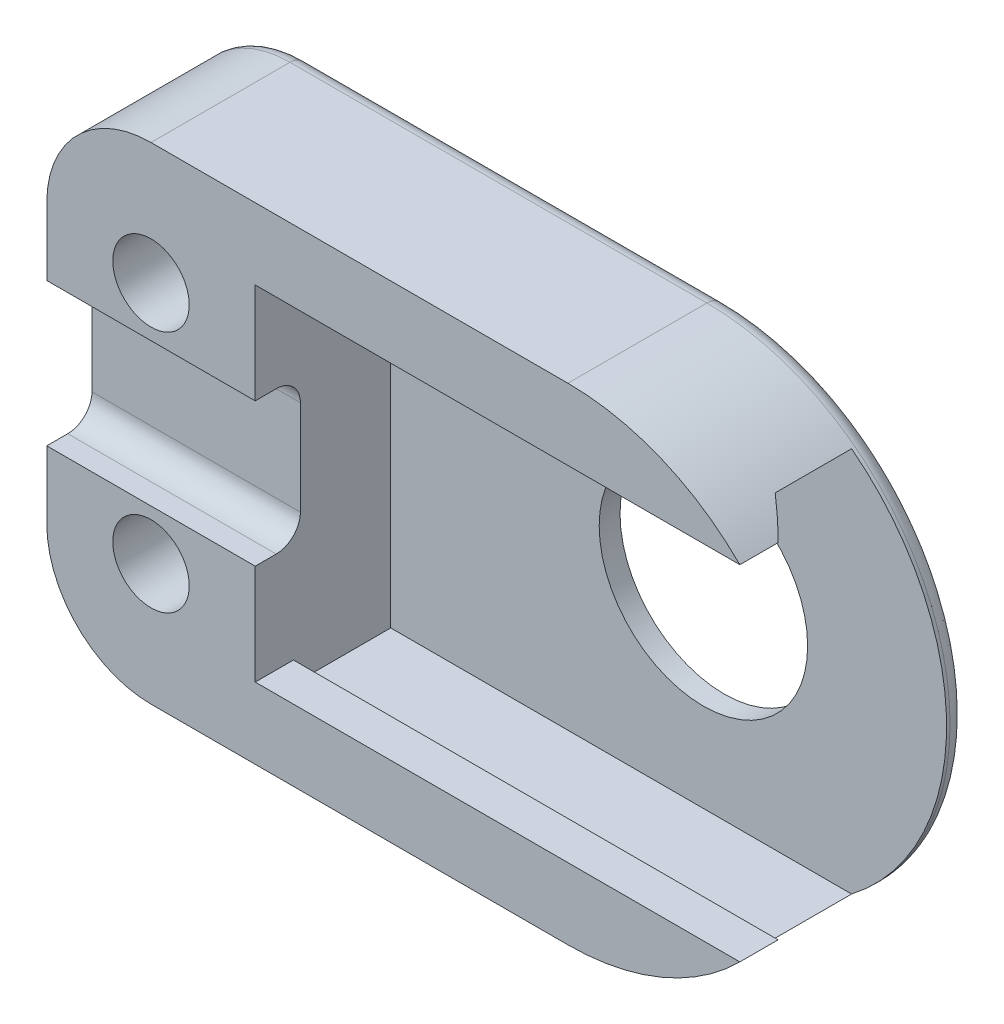
ISO-10303-21;
HEADER;
FILE_DESCRIPTION(('STEP AP214'),'2;1');
FILE_NAME('part.step','',(''),(''),'','','');
FILE_SCHEMA(('AUTOMOTIVE_DESIGN { 1 0 10303 214 1 1 1 1 }'));
ENDSEC;
DATA;
#1=APPLICATION_CONTEXT('core data for automotive mechanical design processes');
#2=APPLICATION_PROTOCOL_DEFINITION('international standard','automotive_design',2000,#1);
#3=PRODUCT_CONTEXT('',#1,'mechanical');
#4=PRODUCT('Part','Part','',(#3));
#5=PRODUCT_RELATED_PRODUCT_CATEGORY('part','',(#4));
#6=PRODUCT_DEFINITION_FORMATION('','',#4);
#7=PRODUCT_DEFINITION_CONTEXT('part definition',#1,'design');
#8=PRODUCT_DEFINITION('design','',#6,#7);
#9=PRODUCT_DEFINITION_SHAPE('','',#8);
#10=(LENGTH_UNIT() NAMED_UNIT(*) SI_UNIT(.MILLI.,.METRE.));
#11=(NAMED_UNIT(*) PLANE_ANGLE_UNIT() SI_UNIT($,.RADIAN.));
#12=(NAMED_UNIT(*) SI_UNIT($,.STERADIAN.) SOLID_ANGLE_UNIT());
#13=UNCERTAINTY_MEASURE_WITH_UNIT(LENGTH_MEASURE(1.E-05),#10,'distance_accuracy_value','');
#14=(GEOMETRIC_REPRESENTATION_CONTEXT(3) GLOBAL_UNCERTAINTY_ASSIGNED_CONTEXT((#13)) GLOBAL_UNIT_ASSIGNED_CONTEXT((#10,
#11,#12)) REPRESENTATION_CONTEXT('',''));
#15=CARTESIAN_POINT('',(0.,0.,0.));
#16=DIRECTION('',(0.,0.,1.));
#17=DIRECTION('',(1.,0.,0.));
#18=AXIS2_PLACEMENT_3D('',#15,#16,#17);
#19=CARTESIAN_POINT('',(0.,0.,4.5));
#20=DIRECTION('',(0.,0.,-0.999999999999998));
#21=DIRECTION('',(-1.,0.,0.));
#22=AXIS2_PLACEMENT_3D('',#19,#20,#21);
#23=PLANE('',#22);
#24=CARTESIAN_POINT('',(-12.,3.49999999999999,4.5));
#25=DIRECTION('',(0.,0.,0.999999999999998));
#26=DIRECTION('',(1.,0.,0.));
#27=AXIS2_PLACEMENT_3D('',#24,#25,#26);
#28=CIRCLE('',#27,1.1);
#29=CARTESIAN_POINT('',(-10.9,3.49999999999999,4.5));
#30=VERTEX_POINT('',#29);
#31=EDGE_CURVE('E380',#30,#30,#28,.T.);
#32=ORIENTED_EDGE('',*,*,#31,.F.);
#33=EDGE_LOOP('',(#32));
#34=FACE_BOUND('',#33,.T.);
#35=DIRECTION('',(-1.,0.,0.));
#36=VECTOR('',#35,1.);
#37=CARTESIAN_POINT('',(-15.,7.00000000000001,4.5));
#38=LINE('',#37,#36);
#39=CARTESIAN_POINT('',(0.,7.00000000000003,4.5));
#40=VERTEX_POINT('',#39);
#41=CARTESIAN_POINT('',(-12.,7.,4.50000000000001));
#42=VERTEX_POINT('',#41);
#43=EDGE_CURVE('E389',#40,#42,#38,.T.);
#44=ORIENTED_EDGE('',*,*,#43,.T.);
#45=CARTESIAN_POINT('',(-12.,4.00000000000001,4.5));
#46=DIRECTION('',(0.,0.,-0.999999999999998));
#47=DIRECTION('',(-1.,0.,0.));
#48=AXIS2_PLACEMENT_3D('',#45,#46,#47);
#49=CIRCLE('',#48,3.);
#50=CARTESIAN_POINT('',(-15.,4.00000000000001,4.5));
#51=VERTEX_POINT('',#50);
#52=EDGE_CURVE('E458',#42,#51,#49,.F.);
#53=ORIENTED_EDGE('',*,*,#52,.T.);
#54=DIRECTION('',(0.,-1.,0.));
#55=VECTOR('',#54,1.);
#56=CARTESIAN_POINT('',(-15.,7.00000000000001,4.5));
#57=LINE('',#56,#55);
#58=CARTESIAN_POINT('',(-15.,2.06,4.5));
#59=VERTEX_POINT('',#58);
#60=EDGE_CURVE('E394',#51,#59,#57,.T.);
#61=ORIENTED_EDGE('',*,*,#60,.T.);
#62=DIRECTION('',(-1.,0.,0.));
#63=VECTOR('',#62,1.);
#64=CARTESIAN_POINT('',(7.00000000000006,2.06000000000004,4.5));
#65=LINE('',#64,#63);
#66=CARTESIAN_POINT('',(-8.99999999999997,2.06000000000005,4.5));
#67=VERTEX_POINT('',#66);
#68=EDGE_CURVE('E274',#67,#59,#65,.T.);
#69=ORIENTED_EDGE('',*,*,#68,.F.);
#70=DIRECTION('',(0.,1.,0.));
#71=VECTOR('',#70,1.);
#72=CARTESIAN_POINT('',(-8.99999999999984,0.,4.5));
#73=LINE('',#72,#71);
#74=CARTESIAN_POINT('',(-8.99999999999999,4.95,4.5));
#75=VERTEX_POINT('',#74);
#76=EDGE_CURVE('E325',#67,#75,#73,.T.);
#77=ORIENTED_EDGE('',*,*,#76,.T.);
#78=DIRECTION('',(-1.,0.,0.));
#79=VECTOR('',#78,1.);
#80=CARTESIAN_POINT('',(7.00000000000001,4.95000000000001,4.50000000000001));
#81=LINE('',#80,#79);
#82=CARTESIAN_POINT('',(4.94949492372722,4.95000000000003,4.5));
#83=VERTEX_POINT('',#82);
#84=EDGE_CURVE('E353',#83,#75,#81,.T.);
#85=ORIENTED_EDGE('',*,*,#84,.F.);
#86=CARTESIAN_POINT('',(0.,0.,4.5));
#87=DIRECTION('',(0.,0.,0.999999999999998));
#88=DIRECTION('',(-1.,0.,0.));
#89=AXIS2_PLACEMENT_3D('',#86,#87,#88);
#90=CIRCLE('',#89,7.);
#91=EDGE_CURVE('E384',#83,#40,#90,.T.);
#92=ORIENTED_EDGE('',*,*,#91,.T.);
#93=EDGE_LOOP('',(#44,#53,#61,#69,#77,#85,#92));
#94=FACE_BOUND('',#93,.T.);
#95=ADVANCED_FACE('F52',(#34,#94),#23,.F.);
#96=CARTESIAN_POINT('',(-12.,-3.50000000000001,4.5));
#97=DIRECTION('',(0.,0.,0.999999999999998));
#98=DIRECTION('',(-1.,0.,0.));
#99=AXIS2_PLACEMENT_3D('',#96,#97,#98);
#100=CIRCLE('',#99,1.1);
#101=CARTESIAN_POINT('',(-13.1,-3.50000000000001,4.5));
#102=VERTEX_POINT('',#101);
#103=EDGE_CURVE('E376',#102,#102,#100,.T.);
#104=ORIENTED_EDGE('',*,*,#103,.F.);
#105=EDGE_LOOP('',(#104));
#106=FACE_BOUND('',#105,.T.);
#107=CARTESIAN_POINT('',(-15.,-2.05999999999999,4.5));
#108=VERTEX_POINT('',#107);
#109=CARTESIAN_POINT('',(-15.,-4.,4.5));
#110=VERTEX_POINT('',#109);
#111=EDGE_CURVE('E393',#108,#110,#57,.T.);
#112=ORIENTED_EDGE('',*,*,#111,.T.);
#113=CARTESIAN_POINT('',(-12.,-4.00000000000003,4.5));
#114=DIRECTION('',(0.,0.,-0.999999999999998));
#115=DIRECTION('',(-1.,0.,0.));
#116=AXIS2_PLACEMENT_3D('',#113,#114,#115);
#117=CIRCLE('',#116,3.);
#118=CARTESIAN_POINT('',(-12.,-7.00000000000001,4.5));
#119=VERTEX_POINT('',#118);
#120=EDGE_CURVE('E464',#110,#119,#117,.F.);
#121=ORIENTED_EDGE('',*,*,#120,.T.);
#122=DIRECTION('',(1.,0.,0.));
#123=VECTOR('',#122,1.);
#124=CARTESIAN_POINT('',(-15.,-7.,4.50000000000001));
#125=LINE('',#124,#123);
#126=CARTESIAN_POINT('',(0.,-6.99999999999999,4.50000000000001));
#127=VERTEX_POINT('',#126);
#128=EDGE_CURVE('E397',#119,#127,#125,.T.);
#129=ORIENTED_EDGE('',*,*,#128,.T.);
#130=CARTESIAN_POINT('',(4.94949492372711,-4.95000000000001,4.5));
#131=VERTEX_POINT('',#130);
#132=EDGE_CURVE('E385',#127,#131,#90,.T.);
#133=ORIENTED_EDGE('',*,*,#132,.T.);
#134=DIRECTION('',(-1.,0.,0.));
#135=VECTOR('',#134,1.);
#136=CARTESIAN_POINT('',(7.00000000000013,-4.95000000000001,4.5));
#137=LINE('',#136,#135);
#138=CARTESIAN_POINT('',(-8.99999999999999,-4.95,4.5));
#139=VERTEX_POINT('',#138);
#140=EDGE_CURVE('E357',#131,#139,#137,.T.);
#141=ORIENTED_EDGE('',*,*,#140,.T.);
#142=CARTESIAN_POINT('',(-8.99999999999999,-2.06,4.5));
#143=VERTEX_POINT('',#142);
#144=EDGE_CURVE('E326',#139,#143,#73,.T.);
#145=ORIENTED_EDGE('',*,*,#144,.T.);
#146=DIRECTION('',(-1.,0.,0.));
#147=VECTOR('',#146,1.);
#148=CARTESIAN_POINT('',(7.00000000000001,-2.06,4.5));
#149=LINE('',#148,#147);
#150=EDGE_CURVE('E299',#143,#108,#149,.T.);
#151=ORIENTED_EDGE('',*,*,#150,.T.);
#152=EDGE_LOOP('',(#112,#121,#129,#133,#141,#145,#151));
#153=FACE_BOUND('',#152,.T.);
#154=ADVANCED_FACE('F567',(#106,#153),#23,.F.);
#155=CARTESIAN_POINT('',(0.,0.,0.));
#156=DIRECTION('',(0.,0.,-0.999999999999998));
#157=DIRECTION('',(-1.,0.,0.));
#158=AXIS2_PLACEMENT_3D('',#155,#156,#157);
#159=PLANE('',#158);
#160=CARTESIAN_POINT('',(-12.,3.49999999999999,0.));
#161=DIRECTION('',(0.,0.,0.999999999999998));
#162=DIRECTION('',(1.,0.,0.));
#163=AXIS2_PLACEMENT_3D('',#160,#161,#162);
#164=CIRCLE('',#163,1.75);
#165=CARTESIAN_POINT('',(-10.25,3.49999999999999,0.));
#166=VERTEX_POINT('',#165);
#167=EDGE_CURVE('E532',#166,#166,#164,.T.);
#168=ORIENTED_EDGE('',*,*,#167,.T.);
#169=EDGE_LOOP('',(#168));
#170=FACE_BOUND('',#169,.T.);
#171=CARTESIAN_POINT('',(-12.,-3.5,0.));
#172=DIRECTION('',(0.,0.,0.999999999999998));
#173=DIRECTION('',(1.,0.,0.));
#174=AXIS2_PLACEMENT_3D('',#171,#172,#173);
#175=CIRCLE('',#174,1.75);
#176=CARTESIAN_POINT('',(-10.25,-3.5,0.));
#177=VERTEX_POINT('',#176);
#178=EDGE_CURVE('E543',#177,#177,#175,.T.);
#179=ORIENTED_EDGE('',*,*,#178,.T.);
#180=EDGE_LOOP('',(#179));
#181=FACE_BOUND('',#180,.T.);
#182=DIRECTION('',(0.,-1.,0.));
#183=VECTOR('',#182,1.);
#184=CARTESIAN_POINT('',(-14.5,4.00000000000001,0.));
#185=LINE('',#184,#183);
#186=CARTESIAN_POINT('',(-14.4999999999999,-3.99999999999999,0.));
#187=VERTEX_POINT('',#186);
#188=CARTESIAN_POINT('',(-14.5,4.00000000000001,0.));
#189=VERTEX_POINT('',#188);
#190=EDGE_CURVE('E467',#187,#189,#185,.F.);
#191=ORIENTED_EDGE('',*,*,#190,.T.);
#192=CARTESIAN_POINT('',(-12.,4.00000000000001,0.));
#193=DIRECTION('',(0.,0.,-0.999999999999998));
#194=DIRECTION('',(-1.,0.,0.));
#195=AXIS2_PLACEMENT_3D('',#192,#193,#194);
#196=CIRCLE('',#195,2.5);
#197=CARTESIAN_POINT('',(-12.,6.5,0.));
#198=VERTEX_POINT('',#197);
#199=EDGE_CURVE('E482',#189,#198,#196,.T.);
#200=ORIENTED_EDGE('',*,*,#199,.T.);
#201=DIRECTION('',(-1.,0.,0.));
#202=VECTOR('',#201,1.);
#203=CARTESIAN_POINT('',(1.2490009027033E-13,6.50000000000002,0.));
#204=LINE('',#203,#202);
#205=CARTESIAN_POINT('',(1.2490009027033E-13,6.50000000000002,0.));
#206=VERTEX_POINT('',#205);
#207=EDGE_CURVE('E479',#198,#206,#204,.F.);
#208=ORIENTED_EDGE('',*,*,#207,.T.);
#209=CARTESIAN_POINT('',(0.,0.,0.));
#210=DIRECTION('',(0.,0.,-0.999999999999998));
#211=DIRECTION('',(-1.,0.,0.));
#212=AXIS2_PLACEMENT_3D('',#209,#210,#211);
#213=CIRCLE('',#212,6.5);
#214=CARTESIAN_POINT('',(0.,-6.50000000000001,0.));
#215=VERTEX_POINT('',#214);
#216=EDGE_CURVE('E476',#206,#215,#213,.T.);
#217=ORIENTED_EDGE('',*,*,#216,.T.);
#218=DIRECTION('',(1.,0.,0.));
#219=VECTOR('',#218,1.);
#220=CARTESIAN_POINT('',(-12.,-6.5,0.));
#221=LINE('',#220,#219);
#222=CARTESIAN_POINT('',(-12.,-6.5,0.));
#223=VERTEX_POINT('',#222);
#224=EDGE_CURVE('E473',#215,#223,#221,.F.);
#225=ORIENTED_EDGE('',*,*,#224,.T.);
#226=CARTESIAN_POINT('',(-12.,-4.00000000000001,0.));
#227=DIRECTION('',(0.,0.,-0.999999999999998));
#228=DIRECTION('',(-1.,0.,0.));
#229=AXIS2_PLACEMENT_3D('',#226,#227,#228);
#230=CIRCLE('',#229,2.5);
#231=EDGE_CURVE('E470',#223,#187,#230,.T.);
#232=ORIENTED_EDGE('',*,*,#231,.T.);
#233=EDGE_LOOP('',(#191,#200,#208,#217,#225,#232));
#234=FACE_BOUND('',#233,.T.);
#235=CARTESIAN_POINT('',(0.,0.,0.));
#236=DIRECTION('',(0.,0.,-0.999999999999998));
#237=DIRECTION('',(-1.,0.,0.));
#238=AXIS2_PLACEMENT_3D('',#235,#236,#237);
#239=CIRCLE('',#238,3.);
#240=CARTESIAN_POINT('',(-3.00000000000001,0.,0.));
#241=VERTEX_POINT('',#240);
#242=EDGE_CURVE('E372',#241,#241,#239,.T.);
#243=ORIENTED_EDGE('',*,*,#242,.F.);
#244=EDGE_LOOP('',(#243));
#245=FACE_BOUND('',#244,.T.);
#246=ADVANCED_FACE('F547',(#170,#181,#234,#245),#159,.T.);
#247=CARTESIAN_POINT('',(0.,0.,4.5));
#248=DIRECTION('',(0.,0.,-0.999999999999998));
#249=DIRECTION('',(-1.,0.,0.));
#250=AXIS2_PLACEMENT_3D('',#247,#248,#249);
#251=CYLINDRICAL_SURFACE('',#250,7.);
#252=DIRECTION('',(0.,0.,-0.999999999999998));
#253=VECTOR('',#252,1.);
#254=CARTESIAN_POINT('',(0.,-6.99999999999999,4.50000000000001));
#255=LINE('',#254,#253);
#256=CARTESIAN_POINT('',(0.,-6.99999999999999,0.500000000000014));
#257=VERTEX_POINT('',#256);
#258=EDGE_CURVE('E400',#127,#257,#255,.T.);
#259=ORIENTED_EDGE('',*,*,#258,.T.);
#260=CARTESIAN_POINT('',(0.,0.,0.5));
#261=DIRECTION('',(0.,0.,-0.999999999999998));
#262=DIRECTION('',(-1.,0.,0.));
#263=AXIS2_PLACEMENT_3D('',#260,#261,#262);
#264=CIRCLE('',#263,7.);
#265=CARTESIAN_POINT('',(0.,7.,0.499999999999999));
#266=VERTEX_POINT('',#265);
#267=EDGE_CURVE('E493',#257,#266,#264,.F.);
#268=ORIENTED_EDGE('',*,*,#267,.T.);
#269=DIRECTION('',(0.,0.,-0.999999999999998));
#270=VECTOR('',#269,1.);
#271=CARTESIAN_POINT('',(0.,7.00000000000003,4.5));
#272=LINE('',#271,#270);
#273=EDGE_CURVE('E404',#40,#266,#272,.T.);
#274=ORIENTED_EDGE('',*,*,#273,.F.);
#275=ORIENTED_EDGE('',*,*,#91,.F.);
#276=DIRECTION('',(0.,0.,-0.999999999999998));
#277=VECTOR('',#276,1.);
#278=CARTESIAN_POINT('',(4.94949492372722,4.95000000000003,4.5));
#279=LINE('',#278,#277);
#280=CARTESIAN_POINT('',(4.94949492372709,4.94999999999999,3.40000000000002));
#281=VERTEX_POINT('',#280);
#282=EDGE_CURVE('E423',#281,#83,#279,.F.);
#283=ORIENTED_EDGE('',*,*,#282,.F.);
#284=CARTESIAN_POINT('',(0.,0.,8.35000000000013));
#285=DIRECTION('',(0.,-0.707106781186558,-0.707106781186536));
#286=DIRECTION('',(0.,0.70710678118654,-0.707106781186555));
#287=AXIS2_PLACEMENT_3D('',#284,#285,#286);
#288=ELLIPSE('',#287,9.8994949366118,7.);
#289=CARTESIAN_POINT('',(4.26585278695829,5.55000000000002,2.8));
#290=VERTEX_POINT('',#289);
#291=EDGE_CURVE('E426',#290,#281,#288,.T.);
#292=ORIENTED_EDGE('',*,*,#291,.F.);
#293=DIRECTION('',(0.,0.,-0.999999999999998));
#294=VECTOR('',#293,1.);
#295=CARTESIAN_POINT('',(4.26585278695846,5.55000000000006,4.5));
#296=LINE('',#295,#294);
#297=CARTESIAN_POINT('',(4.2658527869583,5.55000000000001,0.600000000000014));
#298=VERTEX_POINT('',#297);
#299=EDGE_CURVE('E429',#298,#290,#296,.F.);
#300=ORIENTED_EDGE('',*,*,#299,.F.);
#301=CARTESIAN_POINT('',(0.,0.,0.6));
#302=DIRECTION('',(0.,0.,-0.999999999999998));
#303=DIRECTION('',(-1.,0.,0.));
#304=AXIS2_PLACEMENT_3D('',#301,#302,#303);
#305=CIRCLE('',#304,7.);
#306=CARTESIAN_POINT('',(4.26585278695832,-5.55,0.600000000000028));
#307=VERTEX_POINT('',#306);
#308=EDGE_CURVE('E369',#298,#307,#305,.T.);
#309=ORIENTED_EDGE('',*,*,#308,.T.);
#310=DIRECTION('',(0.,0.,-0.999999999999998));
#311=VECTOR('',#310,1.);
#312=CARTESIAN_POINT('',(4.26585278695833,-5.55000000000002,4.5));
#313=LINE('',#312,#311);
#314=CARTESIAN_POINT('',(4.26585278695833,-5.55,2.8));
#315=VERTEX_POINT('',#314);
#316=EDGE_CURVE('E408',#307,#315,#313,.F.);
#317=ORIENTED_EDGE('',*,*,#316,.T.);
#318=CARTESIAN_POINT('',(0.,0.,8.35000000000012));
#319=DIRECTION('',(0.,-0.707106781186558,0.707106781186537));
#320=DIRECTION('',(0.,-0.70710678118654,-0.707106781186554));
#321=AXIS2_PLACEMENT_3D('',#318,#319,#320);
#322=ELLIPSE('',#321,9.89949493661178,7.);
#323=CARTESIAN_POINT('',(4.94949492372707,-4.95000000000001,3.40000000000002));
#324=VERTEX_POINT('',#323);
#325=EDGE_CURVE('E415',#315,#324,#322,.T.);
#326=ORIENTED_EDGE('',*,*,#325,.T.);
#327=DIRECTION('',(0.,0.,-0.999999999999998));
#328=VECTOR('',#327,1.);
#329=CARTESIAN_POINT('',(4.94949492372711,-4.95000000000001,4.5));
#330=LINE('',#329,#328);
#331=EDGE_CURVE('E419',#324,#131,#330,.F.);
#332=ORIENTED_EDGE('',*,*,#331,.T.);
#333=ORIENTED_EDGE('',*,*,#132,.F.);
#334=EDGE_LOOP('',(#259,#268,#274,#275,#283,#292,#300,#309,#317,#326,#332,#333));
#335=FACE_BOUND('',#334,.T.);
#336=ADVANCED_FACE('F582',(#335),#251,.T.);
#337=CARTESIAN_POINT('',(-15.,7.00000000000001,4.5));
#338=DIRECTION('',(0.,-1.,0.));
#339=DIRECTION('',(0.,0.,-0.999999999999998));
#340=AXIS2_PLACEMENT_3D('',#337,#338,#339);
#341=PLANE('',#340);
#342=ORIENTED_EDGE('',*,*,#273,.T.);
#343=DIRECTION('',(-1.,0.,0.));
#344=VECTOR('',#343,1.);
#345=CARTESIAN_POINT('',(-12.,7.00000000000001,0.500000000000014));
#346=LINE('',#345,#344);
#347=CARTESIAN_POINT('',(-12.,7.00000000000001,0.500000000000014));
#348=VERTEX_POINT('',#347);
#349=EDGE_CURVE('E490',#266,#348,#346,.T.);
#350=ORIENTED_EDGE('',*,*,#349,.T.);
#351=DIRECTION('',(0.,0.,-0.999999999999998));
#352=VECTOR('',#351,1.);
#353=CARTESIAN_POINT('',(-12.,7.,4.50000000000001));
#354=LINE('',#353,#352);
#355=EDGE_CURVE('E455',#348,#42,#354,.F.);
#356=ORIENTED_EDGE('',*,*,#355,.T.);
#357=ORIENTED_EDGE('',*,*,#43,.F.);
#358=EDGE_LOOP('',(#342,#350,#356,#357));
#359=FACE_BOUND('',#358,.T.);
#360=ADVANCED_FACE('F590',(#359),#341,.F.);
#361=CARTESIAN_POINT('',(-15.,7.00000000000001,4.5));
#362=DIRECTION('',(1.,0.,0.));
#363=DIRECTION('',(0.,1.,0.));
#364=AXIS2_PLACEMENT_3D('',#361,#362,#363);
#365=PLANE('',#364);
#366=DIRECTION('',(0.,0.,-0.999999999999998));
#367=VECTOR('',#366,1.);
#368=CARTESIAN_POINT('',(-15.,4.00000000000001,4.5));
#369=LINE('',#368,#367);
#370=CARTESIAN_POINT('',(-15.,4.,0.5));
#371=VERTEX_POINT('',#370);
#372=EDGE_CURVE('E452',#51,#371,#369,.T.);
#373=ORIENTED_EDGE('',*,*,#372,.T.);
#374=DIRECTION('',(0.,-1.,0.));
#375=VECTOR('',#374,1.);
#376=CARTESIAN_POINT('',(-15.,-4.,0.500000000000013));
#377=LINE('',#376,#375);
#378=CARTESIAN_POINT('',(-15.,-4.,0.500000000000013));
#379=VERTEX_POINT('',#378);
#380=EDGE_CURVE('E13',#371,#379,#377,.T.);
#381=ORIENTED_EDGE('',*,*,#380,.T.);
#382=DIRECTION('',(0.,0.,-0.999999999999998));
#383=VECTOR('',#382,1.);
#384=CARTESIAN_POINT('',(-15.,-4.,4.5));
#385=LINE('',#384,#383);
#386=EDGE_CURVE('E449',#379,#110,#385,.F.);
#387=ORIENTED_EDGE('',*,*,#386,.T.);
#388=ORIENTED_EDGE('',*,*,#111,.F.);
#389=DIRECTION('',(0.,0.,0.999999999999998));
#390=VECTOR('',#389,1.);
#391=CARTESIAN_POINT('',(-15.,-2.05999999999999,4.5));
#392=LINE('',#391,#390);
#393=CARTESIAN_POINT('',(-15.,-2.05999999999999,3.89665998448863));
#394=VERTEX_POINT('',#393);
#395=EDGE_CURVE('E267',#394,#108,#392,.T.);
#396=ORIENTED_EDGE('',*,*,#395,.F.);
#397=CARTESIAN_POINT('',(-15.,-1.36334001551138,3.89665998448864));
#398=DIRECTION('',(-1.,0.,0.));
#399=DIRECTION('',(0.,1.,0.));
#400=AXIS2_PLACEMENT_3D('',#397,#398,#399);
#401=CIRCLE('',#400,0.696659984488627);
#402=CARTESIAN_POINT('',(-15.,-1.36334001551138,3.20000000000001));
#403=VERTEX_POINT('',#402);
#404=EDGE_CURVE('E287',#403,#394,#401,.T.);
#405=ORIENTED_EDGE('',*,*,#404,.F.);
#406=DIRECTION('',(0.,-1.,0.));
#407=VECTOR('',#406,1.);
#408=CARTESIAN_POINT('',(-15.,1.36334001551137,3.2));
#409=LINE('',#408,#407);
#410=CARTESIAN_POINT('',(-15.,1.36334001551137,3.2));
#411=VERTEX_POINT('',#410);
#412=EDGE_CURVE('E282',#411,#403,#409,.T.);
#413=ORIENTED_EDGE('',*,*,#412,.F.);
#414=CARTESIAN_POINT('',(-14.9999999999998,1.36334001551141,3.89665998448863));
#415=DIRECTION('',(-1.,0.,0.));
#416=DIRECTION('',(0.,-1.,0.));
#417=AXIS2_PLACEMENT_3D('',#414,#415,#416);
#418=CIRCLE('',#417,0.696659984488628);
#419=CARTESIAN_POINT('',(-15.,2.06,3.89665998448864));
#420=VERTEX_POINT('',#419);
#421=EDGE_CURVE('E259',#420,#411,#418,.T.);
#422=ORIENTED_EDGE('',*,*,#421,.F.);
#423=DIRECTION('',(0.,0.,-0.999999999999998));
#424=VECTOR('',#423,1.);
#425=CARTESIAN_POINT('',(-15.,2.06,4.5));
#426=LINE('',#425,#424);
#427=EDGE_CURVE('E271',#59,#420,#426,.T.);
#428=ORIENTED_EDGE('',*,*,#427,.F.);
#429=ORIENTED_EDGE('',*,*,#60,.F.);
#430=EDGE_LOOP('',(#373,#381,#387,#388,#396,#405,#413,#422,#428,#429));
#431=FACE_BOUND('',#430,.T.);
#432=ADVANCED_FACE('F279',(#431),#365,.F.);
#433=CARTESIAN_POINT('',(-15.,-7.,4.50000000000001));
#434=DIRECTION('',(0.,1.,0.));
#435=DIRECTION('',(0.,0.,0.999999999999998));
#436=AXIS2_PLACEMENT_3D('',#433,#434,#435);
#437=PLANE('',#436);
#438=DIRECTION('',(0.,0.,-0.999999999999998));
#439=VECTOR('',#438,1.);
#440=CARTESIAN_POINT('',(-12.,-7.00000000000001,4.5));
#441=LINE('',#440,#439);
#442=CARTESIAN_POINT('',(-12.,-7.,0.5));
#443=VERTEX_POINT('',#442);
#444=EDGE_CURVE('E461',#119,#443,#441,.T.);
#445=ORIENTED_EDGE('',*,*,#444,.T.);
#446=DIRECTION('',(1.,0.,0.));
#447=VECTOR('',#446,1.);
#448=CARTESIAN_POINT('',(0.,-6.99999999999999,0.500000000000014));
#449=LINE('',#448,#447);
#450=EDGE_CURVE('E496',#443,#257,#449,.T.);
#451=ORIENTED_EDGE('',*,*,#450,.T.);
#452=ORIENTED_EDGE('',*,*,#258,.F.);
#453=ORIENTED_EDGE('',*,*,#128,.F.);
#454=EDGE_LOOP('',(#445,#451,#452,#453));
#455=FACE_BOUND('',#454,.T.);
#456=ADVANCED_FACE('F584',(#455),#437,.F.);
#457=CARTESIAN_POINT('',(-12.,3.49999999999999,4.5));
#458=DIRECTION('',(0.,0.,-0.999999999999998));
#459=DIRECTION('',(-1.,0.,0.));
#460=AXIS2_PLACEMENT_3D('',#457,#458,#459);
#461=CYLINDRICAL_SURFACE('',#460,1.1);
#462=CARTESIAN_POINT('',(-12.,3.5,1.00000000000001));
#463=DIRECTION('',(0.,0.,0.999999999999998));
#464=DIRECTION('',(1.,0.,0.));
#465=AXIS2_PLACEMENT_3D('',#462,#463,#464);
#466=CIRCLE('',#465,1.1);
#467=CARTESIAN_POINT('',(-10.9,3.5,1.00000000000001));
#468=VERTEX_POINT('',#467);
#469=EDGE_CURVE('E56',#468,#468,#466,.T.);
#470=ORIENTED_EDGE('',*,*,#469,.F.);
#471=EDGE_LOOP('',(#470));
#472=FACE_BOUND('',#471,.T.);
#473=ORIENTED_EDGE('',*,*,#31,.T.);
#474=EDGE_LOOP('',(#473));
#475=FACE_BOUND('',#474,.T.);
#476=ADVANCED_FACE('F578',(#472,#475),#461,.F.);
#477=CARTESIAN_POINT('',(-12.,-3.50000000000001,4.5));
#478=DIRECTION('',(0.,0.,-0.999999999999998));
#479=DIRECTION('',(-1.,0.,0.));
#480=AXIS2_PLACEMENT_3D('',#477,#478,#479);
#481=CYLINDRICAL_SURFACE('',#480,1.1);
#482=CARTESIAN_POINT('',(-12.,-3.50000000000001,1.));
#483=DIRECTION('',(0.,0.,0.999999999999998));
#484=DIRECTION('',(1.,0.,0.));
#485=AXIS2_PLACEMENT_3D('',#482,#483,#484);
#486=CIRCLE('',#485,1.1);
#487=CARTESIAN_POINT('',(-10.9,-3.50000000000001,1.));
#488=VERTEX_POINT('',#487);
#489=EDGE_CURVE('E521',#488,#488,#486,.T.);
#490=ORIENTED_EDGE('',*,*,#489,.F.);
#491=EDGE_LOOP('',(#490));
#492=FACE_BOUND('',#491,.T.);
#493=ORIENTED_EDGE('',*,*,#103,.T.);
#494=EDGE_LOOP('',(#493));
#495=FACE_BOUND('',#494,.T.);
#496=ADVANCED_FACE('F677',(#492,#495),#481,.F.);
#497=CARTESIAN_POINT('',(0.,0.,9.99999999999999));
#498=DIRECTION('',(0.,0.,-0.999999999999998));
#499=DIRECTION('',(-1.,0.,0.));
#500=AXIS2_PLACEMENT_3D('',#497,#498,#499);
#501=CYLINDRICAL_SURFACE('',#500,3.);
#502=CARTESIAN_POINT('',(0.,0.,0.6));
#503=DIRECTION('',(0.,0.,-0.999999999999998));
#504=DIRECTION('',(-1.,0.,0.));
#505=AXIS2_PLACEMENT_3D('',#502,#503,#504);
#506=CIRCLE('',#505,3.);
#507=CARTESIAN_POINT('',(-3.00000000000001,0.,0.6));
#508=VERTEX_POINT('',#507);
#509=EDGE_CURVE('E346',#508,#508,#506,.F.);
#510=ORIENTED_EDGE('',*,*,#509,.T.);
#511=EDGE_LOOP('',(#510));
#512=FACE_BOUND('',#511,.T.);
#513=ORIENTED_EDGE('',*,*,#242,.T.);
#514=EDGE_LOOP('',(#513));
#515=FACE_BOUND('',#514,.T.);
#516=ADVANCED_FACE('F674',(#512,#515),#501,.F.);
#517=CARTESIAN_POINT('',(7.00000000000001,5.55,0.));
#518=DIRECTION('',(0.,-1.,0.));
#519=DIRECTION('',(0.,0.,-0.999999999999998));
#520=AXIS2_PLACEMENT_3D('',#517,#518,#519);
#521=PLANE('',#520);
#522=ORIENTED_EDGE('',*,*,#299,.T.);
#523=DIRECTION('',(-1.,0.,0.));
#524=VECTOR('',#523,1.);
#525=CARTESIAN_POINT('',(7.00000000000001,5.55,2.80000000000001));
#526=LINE('',#525,#524);
#527=CARTESIAN_POINT('',(-9.00000000000001,5.55000000000001,2.80000000000001));
#528=VERTEX_POINT('',#527);
#529=EDGE_CURVE('E347',#290,#528,#526,.T.);
#530=ORIENTED_EDGE('',*,*,#529,.T.);
#531=DIRECTION('',(0.,0.,0.999999999999998));
#532=VECTOR('',#531,1.);
#533=CARTESIAN_POINT('',(-9.00000000000001,5.55,0.));
#534=LINE('',#533,#532);
#535=CARTESIAN_POINT('',(-9.00000000000001,5.55,0.600000000000014));
#536=VERTEX_POINT('',#535);
#537=EDGE_CURVE('E338',#536,#528,#534,.T.);
#538=ORIENTED_EDGE('',*,*,#537,.F.);
#539=DIRECTION('',(-1.,0.,0.));
#540=VECTOR('',#539,1.);
#541=CARTESIAN_POINT('',(7.00000000000001,5.55,0.600000000000028));
#542=LINE('',#541,#540);
#543=EDGE_CURVE('E343',#298,#536,#542,.T.);
#544=ORIENTED_EDGE('',*,*,#543,.F.);
#545=EDGE_LOOP('',(#522,#530,#538,#544));
#546=FACE_BOUND('',#545,.T.);
#547=ADVANCED_FACE('F676',(#546),#521,.T.);
#548=CARTESIAN_POINT('',(7.00000000000005,4.17500000000009,4.17499999999996));
#549=DIRECTION('',(0.,-0.707106781186558,-0.707106781186536));
#550=DIRECTION('',(0.,0.70710678118654,-0.707106781186555));
#551=AXIS2_PLACEMENT_3D('',#548,#549,#550);
#552=PLANE('',#551);
#553=ORIENTED_EDGE('',*,*,#291,.T.);
#554=DIRECTION('',(-1.,0.,0.));
#555=VECTOR('',#554,1.);
#556=CARTESIAN_POINT('',(7.00000000000001,4.95000000000003,3.40000000000003));
#557=LINE('',#556,#555);
#558=CARTESIAN_POINT('',(-9.00000000000001,4.94999999999999,3.40000000000003));
#559=VERTEX_POINT('',#558);
#560=EDGE_CURVE('E350',#281,#559,#557,.T.);
#561=ORIENTED_EDGE('',*,*,#560,.T.);
#562=DIRECTION('',(0.,-0.70710678118654,0.707106781186555));
#563=VECTOR('',#562,1.);
#564=CARTESIAN_POINT('',(-8.99999999999999,4.17500000000008,4.17499999999996));
#565=LINE('',#564,#563);
#566=EDGE_CURVE('E334',#528,#559,#565,.T.);
#567=ORIENTED_EDGE('',*,*,#566,.F.);
#568=ORIENTED_EDGE('',*,*,#529,.F.);
#569=EDGE_LOOP('',(#553,#561,#567,#568));
#570=FACE_BOUND('',#569,.T.);
#571=ADVANCED_FACE('F655',(#570),#552,.T.);
#572=CARTESIAN_POINT('',(6.99999999999998,4.95000000000003,0.));
#573=DIRECTION('',(0.,-1.,0.));
#574=DIRECTION('',(1.,0.,0.));
#575=AXIS2_PLACEMENT_3D('',#572,#573,#574);
#576=PLANE('',#575);
#577=ORIENTED_EDGE('',*,*,#282,.T.);
#578=ORIENTED_EDGE('',*,*,#84,.T.);
#579=DIRECTION('',(0.,0.,0.999999999999998));
#580=VECTOR('',#579,1.);
#581=CARTESIAN_POINT('',(-9.00000000000001,4.94999999999999,0.));
#582=LINE('',#581,#580);
#583=EDGE_CURVE('E330',#559,#75,#582,.T.);
#584=ORIENTED_EDGE('',*,*,#583,.F.);
#585=ORIENTED_EDGE('',*,*,#560,.F.);
#586=EDGE_LOOP('',(#577,#578,#584,#585));
#587=FACE_BOUND('',#586,.T.);
#588=ADVANCED_FACE('F646',(#587),#576,.T.);
#589=CARTESIAN_POINT('',(7.00000000000001,-4.94999999999999,0.));
#590=DIRECTION('',(0.,-1.,0.));
#591=DIRECTION('',(1.,0.,0.));
#592=AXIS2_PLACEMENT_3D('',#589,#590,#591);
#593=PLANE('',#592);
#594=DIRECTION('',(-1.,0.,0.));
#595=VECTOR('',#594,1.);
#596=CARTESIAN_POINT('',(7.00000000000001,-4.94999999999999,3.40000000000001));
#597=LINE('',#596,#595);
#598=CARTESIAN_POINT('',(-9.00000000000001,-4.95000000000001,3.40000000000003));
#599=VERTEX_POINT('',#598);
#600=EDGE_CURVE('E361',#324,#599,#597,.T.);
#601=ORIENTED_EDGE('',*,*,#600,.T.);
#602=DIRECTION('',(0.,0.,0.999999999999998));
#603=VECTOR('',#602,1.);
#604=CARTESIAN_POINT('',(-9.00000000000001,-4.95000000000001,0.));
#605=LINE('',#604,#603);
#606=EDGE_CURVE('E321',#599,#139,#605,.T.);
#607=ORIENTED_EDGE('',*,*,#606,.T.);
#608=ORIENTED_EDGE('',*,*,#140,.F.);
#609=ORIENTED_EDGE('',*,*,#331,.F.);
#610=EDGE_LOOP('',(#601,#607,#608,#609));
#611=FACE_BOUND('',#610,.T.);
#612=ADVANCED_FACE('F699',(#611),#593,.F.);
#613=CARTESIAN_POINT('',(7.00000000000013,-4.1750000000001,4.17499999999997));
#614=DIRECTION('',(0.,-0.707106781186558,0.707106781186537));
#615=DIRECTION('',(0.,-0.707106781186541,-0.707106781186554));
#616=AXIS2_PLACEMENT_3D('',#613,#614,#615);
#617=PLANE('',#616);
#618=DIRECTION('',(-1.,0.,0.));
#619=VECTOR('',#618,1.);
#620=CARTESIAN_POINT('',(7.00000000000001,-5.55,2.80000000000001));
#621=LINE('',#620,#619);
#622=CARTESIAN_POINT('',(-9.00000000000001,-5.55000000000001,2.80000000000001));
#623=VERTEX_POINT('',#622);
#624=EDGE_CURVE('E364',#315,#623,#621,.T.);
#625=ORIENTED_EDGE('',*,*,#624,.T.);
#626=DIRECTION('',(0.,0.707106781186541,0.707106781186554));
#627=VECTOR('',#626,1.);
#628=CARTESIAN_POINT('',(-8.99999999999999,-4.17500000000007,4.17499999999997));
#629=LINE('',#628,#627);
#630=EDGE_CURVE('E317',#623,#599,#629,.T.);
#631=ORIENTED_EDGE('',*,*,#630,.T.);
#632=ORIENTED_EDGE('',*,*,#600,.F.);
#633=ORIENTED_EDGE('',*,*,#325,.F.);
#634=EDGE_LOOP('',(#625,#631,#632,#633));
#635=FACE_BOUND('',#634,.T.);
#636=ADVANCED_FACE('F695',(#635),#617,.F.);
#637=CARTESIAN_POINT('',(7.00000000000001,-5.54999999999999,0.));
#638=DIRECTION('',(0.,-1.,0.));
#639=DIRECTION('',(0.,0.,-0.999999999999998));
#640=AXIS2_PLACEMENT_3D('',#637,#638,#639);
#641=PLANE('',#640);
#642=DIRECTION('',(-1.,0.,0.));
#643=VECTOR('',#642,1.);
#644=CARTESIAN_POINT('',(7.00000000000001,-5.54999999999999,0.600000000000014));
#645=LINE('',#644,#643);
#646=CARTESIAN_POINT('',(-9.00000000000001,-5.55000000000002,0.600000000000028));
#647=VERTEX_POINT('',#646);
#648=EDGE_CURVE('E342',#307,#647,#645,.T.);
#649=ORIENTED_EDGE('',*,*,#648,.T.);
#650=DIRECTION('',(0.,0.,0.999999999999998));
#651=VECTOR('',#650,1.);
#652=CARTESIAN_POINT('',(-9.00000000000001,-5.55,0.));
#653=LINE('',#652,#651);
#654=EDGE_CURVE('E313',#647,#623,#653,.T.);
#655=ORIENTED_EDGE('',*,*,#654,.T.);
#656=ORIENTED_EDGE('',*,*,#624,.F.);
#657=ORIENTED_EDGE('',*,*,#316,.F.);
#658=EDGE_LOOP('',(#649,#655,#656,#657));
#659=FACE_BOUND('',#658,.T.);
#660=ADVANCED_FACE('F691',(#659),#641,.F.);
#661=CARTESIAN_POINT('',(7.00000000000001,0.,0.6));
#662=DIRECTION('',(0.,0.,-0.999999999999998));
#663=DIRECTION('',(-1.,0.,0.));
#664=AXIS2_PLACEMENT_3D('',#661,#662,#663);
#665=PLANE('',#664);
#666=ORIENTED_EDGE('',*,*,#509,.F.);
#667=EDGE_LOOP('',(#666));
#668=FACE_BOUND('',#667,.T.);
#669=ORIENTED_EDGE('',*,*,#543,.T.);
#670=DIRECTION('',(0.,-1.,0.));
#671=VECTOR('',#670,1.);
#672=CARTESIAN_POINT('',(-8.99999999999995,0.,0.6));
#673=LINE('',#672,#671);
#674=EDGE_CURVE('E298',#536,#647,#673,.T.);
#675=ORIENTED_EDGE('',*,*,#674,.T.);
#676=ORIENTED_EDGE('',*,*,#648,.F.);
#677=ORIENTED_EDGE('',*,*,#308,.F.);
#678=EDGE_LOOP('',(#669,#675,#676,#677));
#679=FACE_BOUND('',#678,.T.);
#680=ADVANCED_FACE('F688',(#668,#679),#665,.F.);
#681=CARTESIAN_POINT('',(-8.99999999999993,0.,0.));
#682=DIRECTION('',(-1.,0.,0.));
#683=DIRECTION('',(0.,-1.,0.));
#684=AXIS2_PLACEMENT_3D('',#681,#682,#683);
#685=PLANE('',#684);
#686=ORIENTED_EDGE('',*,*,#76,.F.);
#687=DIRECTION('',(0.,0.,-0.999999999999998));
#688=VECTOR('',#687,1.);
#689=CARTESIAN_POINT('',(-9.00000000000001,2.06,0.));
#690=LINE('',#689,#688);
#691=CARTESIAN_POINT('',(-8.99999999999997,2.06000000000004,3.89665998448864));
#692=VERTEX_POINT('',#691);
#693=EDGE_CURVE('E446',#67,#692,#690,.T.);
#694=ORIENTED_EDGE('',*,*,#693,.T.);
#695=CARTESIAN_POINT('',(-8.99999999999997,1.36334001551139,3.89665998448864));
#696=DIRECTION('',(-1.,0.,0.));
#697=DIRECTION('',(0.,-1.,0.));
#698=AXIS2_PLACEMENT_3D('',#695,#696,#697);
#699=CIRCLE('',#698,0.696659984488628);
#700=CARTESIAN_POINT('',(-9.00000000000001,1.36334001551139,3.20000000000001));
#701=VERTEX_POINT('',#700);
#702=EDGE_CURVE('E262',#692,#701,#699,.T.);
#703=ORIENTED_EDGE('',*,*,#702,.T.);
#704=DIRECTION('',(0.,-1.,0.));
#705=VECTOR('',#704,1.);
#706=CARTESIAN_POINT('',(-9.00000000000001,0.,3.2));
#707=LINE('',#706,#705);
#708=CARTESIAN_POINT('',(-9.00000000000001,-1.36334001551136,3.20000000000001));
#709=VERTEX_POINT('',#708);
#710=EDGE_CURVE('E434',#701,#709,#707,.T.);
#711=ORIENTED_EDGE('',*,*,#710,.T.);
#712=CARTESIAN_POINT('',(-8.99999999999999,-1.36334001551137,3.89665998448864));
#713=DIRECTION('',(-1.,0.,0.));
#714=DIRECTION('',(0.,-1.,0.));
#715=AXIS2_PLACEMENT_3D('',#712,#713,#714);
#716=CIRCLE('',#715,0.696659984488627);
#717=CARTESIAN_POINT('',(-8.99999999999999,-2.06,3.89665998448864));
#718=VERTEX_POINT('',#717);
#719=EDGE_CURVE('E438',#709,#718,#716,.T.);
#720=ORIENTED_EDGE('',*,*,#719,.T.);
#721=DIRECTION('',(0.,0.,0.999999999999998));
#722=VECTOR('',#721,1.);
#723=CARTESIAN_POINT('',(-9.00000000000001,-2.06,0.));
#724=LINE('',#723,#722);
#725=EDGE_CURVE('E442',#718,#143,#724,.T.);
#726=ORIENTED_EDGE('',*,*,#725,.T.);
#727=ORIENTED_EDGE('',*,*,#144,.F.);
#728=ORIENTED_EDGE('',*,*,#606,.F.);
#729=ORIENTED_EDGE('',*,*,#630,.F.);
#730=ORIENTED_EDGE('',*,*,#654,.F.);
#731=ORIENTED_EDGE('',*,*,#674,.F.);
#732=ORIENTED_EDGE('',*,*,#537,.T.);
#733=ORIENTED_EDGE('',*,*,#566,.T.);
#734=ORIENTED_EDGE('',*,*,#583,.T.);
#735=EDGE_LOOP('',(#686,#694,#703,#711,#720,#726,#727,#728,#729,#730,#731,#732,#733,#734));
#736=FACE_BOUND('',#735,.T.);
#737=ADVANCED_FACE('F649',(#736),#685,.F.);
#738=CARTESIAN_POINT('',(7.00000000000006,2.06000000000004,4.5));
#739=DIRECTION('',(0.,1.,0.));
#740=DIRECTION('',(-1.,0.,0.));
#741=AXIS2_PLACEMENT_3D('',#738,#739,#740);
#742=PLANE('',#741);
#743=ORIENTED_EDGE('',*,*,#68,.T.);
#744=ORIENTED_EDGE('',*,*,#427,.T.);
#745=DIRECTION('',(-1.,0.,0.));
#746=VECTOR('',#745,1.);
#747=CARTESIAN_POINT('',(7.00000000000006,2.06000000000004,3.89665998448864));
#748=LINE('',#747,#746);
#749=EDGE_CURVE('E255',#692,#420,#748,.T.);
#750=ORIENTED_EDGE('',*,*,#749,.F.);
#751=ORIENTED_EDGE('',*,*,#693,.F.);
#752=EDGE_LOOP('',(#743,#744,#750,#751));
#753=FACE_BOUND('',#752,.T.);
#754=ADVANCED_FACE('F272',(#753),#742,.F.);
#755=CARTESIAN_POINT('',(7.00000000000001,-2.06,4.5));
#756=DIRECTION('',(0.,-1.,0.));
#757=DIRECTION('',(0.,0.,-0.999999999999998));
#758=AXIS2_PLACEMENT_3D('',#755,#756,#757);
#759=PLANE('',#758);
#760=DIRECTION('',(-1.,0.,0.));
#761=VECTOR('',#760,1.);
#762=CARTESIAN_POINT('',(7.00000000000001,-2.06000000000001,3.89665998448864));
#763=LINE('',#762,#761);
#764=EDGE_CURVE('E302',#718,#394,#763,.T.);
#765=ORIENTED_EDGE('',*,*,#764,.T.);
#766=ORIENTED_EDGE('',*,*,#395,.T.);
#767=ORIENTED_EDGE('',*,*,#150,.F.);
#768=ORIENTED_EDGE('',*,*,#725,.F.);
#769=EDGE_LOOP('',(#765,#766,#767,#768));
#770=FACE_BOUND('',#769,.T.);
#771=ADVANCED_FACE('F712',(#770),#759,.F.);
#772=CARTESIAN_POINT('',(7.00000000000002,-1.36334001551137,3.89665998448864));
#773=DIRECTION('',(-1.,0.,0.));
#774=DIRECTION('',(0.,-1.,0.));
#775=AXIS2_PLACEMENT_3D('',#772,#773,#774);
#776=CYLINDRICAL_SURFACE('',#775,0.696659984488627);
#777=DIRECTION('',(-1.,0.,0.));
#778=VECTOR('',#777,1.);
#779=CARTESIAN_POINT('',(7.00000000000001,-1.36334001551138,3.20000000000001));
#780=LINE('',#779,#778);
#781=EDGE_CURVE('E305',#709,#403,#780,.T.);
#782=ORIENTED_EDGE('',*,*,#781,.T.);
#783=ORIENTED_EDGE('',*,*,#404,.T.);
#784=ORIENTED_EDGE('',*,*,#764,.F.);
#785=ORIENTED_EDGE('',*,*,#719,.F.);
#786=EDGE_LOOP('',(#782,#783,#784,#785));
#787=FACE_BOUND('',#786,.T.);
#788=ADVANCED_FACE('F718',(#787),#776,.F.);
#789=CARTESIAN_POINT('',(7.00000000000001,1.36334001551138,3.20000000000001));
#790=DIRECTION('',(0.,0.,-0.999999999999998));
#791=DIRECTION('',(0.,1.,0.));
#792=AXIS2_PLACEMENT_3D('',#789,#790,#791);
#793=PLANE('',#792);
#794=DIRECTION('',(-1.,0.,0.));
#795=VECTOR('',#794,1.);
#796=CARTESIAN_POINT('',(7.00000000000001,1.36334001551138,3.20000000000001));
#797=LINE('',#796,#795);
#798=EDGE_CURVE('E266',#701,#411,#797,.T.);
#799=ORIENTED_EDGE('',*,*,#798,.T.);
#800=ORIENTED_EDGE('',*,*,#412,.T.);
#801=ORIENTED_EDGE('',*,*,#781,.F.);
#802=ORIENTED_EDGE('',*,*,#710,.F.);
#803=EDGE_LOOP('',(#799,#800,#801,#802));
#804=FACE_BOUND('',#803,.T.);
#805=ADVANCED_FACE('F715',(#804),#793,.F.);
#806=CARTESIAN_POINT('',(7.00000000000008,1.36334001551138,3.89665998448864));
#807=DIRECTION('',(-1.,0.,0.));
#808=DIRECTION('',(0.,-1.,0.));
#809=AXIS2_PLACEMENT_3D('',#806,#807,#808);
#810=CYLINDRICAL_SURFACE('',#809,0.696659984488628);
#811=ORIENTED_EDGE('',*,*,#749,.T.);
#812=ORIENTED_EDGE('',*,*,#421,.T.);
#813=ORIENTED_EDGE('',*,*,#798,.F.);
#814=ORIENTED_EDGE('',*,*,#702,.F.);
#815=EDGE_LOOP('',(#811,#812,#813,#814));
#816=FACE_BOUND('',#815,.T.);
#817=ADVANCED_FACE('F257',(#816),#810,.F.);
#818=CARTESIAN_POINT('',(-12.,4.00000000000001,4.5));
#819=DIRECTION('',(0.,0.,-0.999999999999998));
#820=DIRECTION('',(-1.,0.,0.));
#821=AXIS2_PLACEMENT_3D('',#818,#819,#820);
#822=CYLINDRICAL_SURFACE('',#821,3.);
#823=ORIENTED_EDGE('',*,*,#355,.F.);
#824=CARTESIAN_POINT('',(-12.,4.00000000000002,0.500000000000014));
#825=DIRECTION('',(0.,0.,-0.999999999999998));
#826=DIRECTION('',(-1.,0.,0.));
#827=AXIS2_PLACEMENT_3D('',#824,#825,#826);
#828=CIRCLE('',#827,3.);
#829=EDGE_CURVE('E486',#348,#371,#828,.F.);
#830=ORIENTED_EDGE('',*,*,#829,.T.);
#831=ORIENTED_EDGE('',*,*,#372,.F.);
#832=ORIENTED_EDGE('',*,*,#52,.F.);
#833=EDGE_LOOP('',(#823,#830,#831,#832));
#834=FACE_BOUND('',#833,.T.);
#835=ADVANCED_FACE('F597',(#834),#822,.T.);
#836=CARTESIAN_POINT('',(-12.,-4.00000000000003,4.5));
#837=DIRECTION('',(0.,0.,-0.999999999999998));
#838=DIRECTION('',(-1.,0.,0.));
#839=AXIS2_PLACEMENT_3D('',#836,#837,#838);
#840=CYLINDRICAL_SURFACE('',#839,3.);
#841=ORIENTED_EDGE('',*,*,#386,.F.);
#842=CARTESIAN_POINT('',(-12.,-4.00000000000001,0.500000000000014));
#843=DIRECTION('',(0.,0.,-0.999999999999998));
#844=DIRECTION('',(-1.,0.,0.));
#845=AXIS2_PLACEMENT_3D('',#842,#843,#844);
#846=CIRCLE('',#845,3.);
#847=EDGE_CURVE('E62',#379,#443,#846,.F.);
#848=ORIENTED_EDGE('',*,*,#847,.T.);
#849=ORIENTED_EDGE('',*,*,#444,.F.);
#850=ORIENTED_EDGE('',*,*,#120,.F.);
#851=EDGE_LOOP('',(#841,#848,#849,#850));
#852=FACE_BOUND('',#851,.T.);
#853=ADVANCED_FACE('F600',(#852),#840,.T.);
#854=CARTESIAN_POINT('',(-15.,-6.5,0.500000000000014));
#855=DIRECTION('',(-1.,0.,0.));
#856=DIRECTION('',(0.,0.,0.999999999999998));
#857=AXIS2_PLACEMENT_3D('',#854,#855,#856);
#858=CYLINDRICAL_SURFACE('',#857,0.5);
#859=CARTESIAN_POINT('',(0.,-6.50000000000001,0.500000000000014));
#860=DIRECTION('',(1.,0.,0.));
#861=DIRECTION('',(0.,0.,-0.999999999999998));
#862=AXIS2_PLACEMENT_3D('',#859,#860,#861);
#863=CIRCLE('',#862,0.5);
#864=EDGE_CURVE('E515',#257,#215,#863,.T.);
#865=ORIENTED_EDGE('',*,*,#864,.F.);
#866=ORIENTED_EDGE('',*,*,#450,.F.);
#867=CARTESIAN_POINT('',(-12.,-6.5,0.5));
#868=DIRECTION('',(-1.,0.,0.));
#869=DIRECTION('',(0.,0.,0.999999999999998));
#870=AXIS2_PLACEMENT_3D('',#867,#868,#869);
#871=CIRCLE('',#870,0.5);
#872=EDGE_CURVE('E277',#223,#443,#871,.T.);
#873=ORIENTED_EDGE('',*,*,#872,.F.);
#874=ORIENTED_EDGE('',*,*,#224,.F.);
#875=EDGE_LOOP('',(#865,#866,#873,#874));
#876=FACE_BOUND('',#875,.T.);
#877=ADVANCED_FACE('F54',(#876),#858,.T.);
#878=CARTESIAN_POINT('',(-12.,-4.00000000000001,0.500000000000014));
#879=DIRECTION('',(0.,0.,-0.999999999999998));
#880=DIRECTION('',(-1.,0.,0.));
#881=AXIS2_PLACEMENT_3D('',#878,#879,#880);
#882=TOROIDAL_SURFACE('',#881,2.5,0.5);
#883=ORIENTED_EDGE('',*,*,#872,.T.);
#884=ORIENTED_EDGE('',*,*,#847,.F.);
#885=CARTESIAN_POINT('',(-14.5,-3.99999999999999,0.5));
#886=DIRECTION('',(0.,1.,0.));
#887=DIRECTION('',(0.,0.,0.999999999999998));
#888=AXIS2_PLACEMENT_3D('',#885,#886,#887);
#889=CIRCLE('',#888,0.5);
#890=EDGE_CURVE('E511',#187,#379,#889,.T.);
#891=ORIENTED_EDGE('',*,*,#890,.F.);
#892=ORIENTED_EDGE('',*,*,#231,.F.);
#893=EDGE_LOOP('',(#883,#884,#891,#892));
#894=FACE_BOUND('',#893,.T.);
#895=ADVANCED_FACE('F613',(#894),#882,.T.);
#896=CARTESIAN_POINT('',(0.,0.,0.5));
#897=DIRECTION('',(0.,0.,-0.999999999999998));
#898=DIRECTION('',(-1.,0.,0.));
#899=AXIS2_PLACEMENT_3D('',#896,#897,#898);
#900=TOROIDAL_SURFACE('',#899,6.5,0.5);
#901=ORIENTED_EDGE('',*,*,#864,.T.);
#902=ORIENTED_EDGE('',*,*,#216,.F.);
#903=CARTESIAN_POINT('',(1.2490009027033E-13,6.50000000000002,0.500000000000013));
#904=DIRECTION('',(-1.,0.,0.));
#905=DIRECTION('',(0.,0.,0.999999999999998));
#906=AXIS2_PLACEMENT_3D('',#903,#904,#905);
#907=CIRCLE('',#906,0.5);
#908=EDGE_CURVE('E507',#266,#206,#907,.T.);
#909=ORIENTED_EDGE('',*,*,#908,.F.);
#910=ORIENTED_EDGE('',*,*,#267,.F.);
#911=EDGE_LOOP('',(#901,#902,#909,#910));
#912=FACE_BOUND('',#911,.T.);
#913=ADVANCED_FACE('F610',(#912),#900,.T.);
#914=CARTESIAN_POINT('',(-14.5,7.00000000000001,0.5));
#915=DIRECTION('',(0.,1.,0.));
#916=DIRECTION('',(-1.,0.,0.));
#917=AXIS2_PLACEMENT_3D('',#914,#915,#916);
#918=CYLINDRICAL_SURFACE('',#917,0.5);
#919=ORIENTED_EDGE('',*,*,#890,.T.);
#920=ORIENTED_EDGE('',*,*,#380,.F.);
#921=CARTESIAN_POINT('',(-14.5,4.00000000000001,0.500000000000014));
#922=DIRECTION('',(0.,1.,0.));
#923=DIRECTION('',(0.,0.,0.999999999999998));
#924=AXIS2_PLACEMENT_3D('',#921,#922,#923);
#925=CIRCLE('',#924,0.5);
#926=EDGE_CURVE('E504',#189,#371,#925,.T.);
#927=ORIENTED_EDGE('',*,*,#926,.F.);
#928=ORIENTED_EDGE('',*,*,#190,.F.);
#929=EDGE_LOOP('',(#919,#920,#927,#928));
#930=FACE_BOUND('',#929,.T.);
#931=ADVANCED_FACE('F606',(#930),#918,.T.);
#932=CARTESIAN_POINT('',(-15.,6.5,0.500000000000013));
#933=DIRECTION('',(1.,0.,0.));
#934=DIRECTION('',(0.,0.,-0.999999999999998));
#935=AXIS2_PLACEMENT_3D('',#932,#933,#934);
#936=CYLINDRICAL_SURFACE('',#935,0.5);
#937=ORIENTED_EDGE('',*,*,#908,.T.);
#938=ORIENTED_EDGE('',*,*,#207,.F.);
#939=CARTESIAN_POINT('',(-12.,6.50000000000001,0.499999999999999));
#940=DIRECTION('',(-1.,0.,0.));
#941=DIRECTION('',(0.,0.,0.999999999999998));
#942=AXIS2_PLACEMENT_3D('',#939,#940,#941);
#943=CIRCLE('',#942,0.5);
#944=EDGE_CURVE('E501',#348,#198,#943,.T.);
#945=ORIENTED_EDGE('',*,*,#944,.F.);
#946=ORIENTED_EDGE('',*,*,#349,.F.);
#947=EDGE_LOOP('',(#937,#938,#945,#946));
#948=FACE_BOUND('',#947,.T.);
#949=ADVANCED_FACE('F562',(#948),#936,.T.);
#950=CARTESIAN_POINT('',(-12.,4.00000000000002,0.500000000000014));
#951=DIRECTION('',(0.,0.,-0.999999999999998));
#952=DIRECTION('',(-1.,0.,0.));
#953=AXIS2_PLACEMENT_3D('',#950,#951,#952);
#954=TOROIDAL_SURFACE('',#953,2.5,0.5);
#955=ORIENTED_EDGE('',*,*,#926,.T.);
#956=ORIENTED_EDGE('',*,*,#829,.F.);
#957=ORIENTED_EDGE('',*,*,#944,.T.);
#958=ORIENTED_EDGE('',*,*,#199,.F.);
#959=EDGE_LOOP('',(#955,#956,#957,#958));
#960=FACE_BOUND('',#959,.T.);
#961=ADVANCED_FACE('F553',(#960),#954,.T.);
#962=CARTESIAN_POINT('',(-12.,-3.50000000000001,1.));
#963=DIRECTION('',(0.,0.,-0.999999999999998));
#964=DIRECTION('',(-1.,0.,0.));
#965=AXIS2_PLACEMENT_3D('',#962,#963,#964);
#966=CYLINDRICAL_SURFACE('',#965,1.75);
#967=CARTESIAN_POINT('',(-12.,-3.50000000000001,1.));
#968=DIRECTION('',(0.,0.,0.999999999999998));
#969=DIRECTION('',(1.,0.,0.));
#970=AXIS2_PLACEMENT_3D('',#967,#968,#969);
#971=CIRCLE('',#970,1.75);
#972=CARTESIAN_POINT('',(-10.25,-3.50000000000001,1.));
#973=VERTEX_POINT('',#972);
#974=EDGE_CURVE('E538',#973,#973,#971,.T.);
#975=ORIENTED_EDGE('',*,*,#974,.T.);
#976=EDGE_LOOP('',(#975));
#977=FACE_BOUND('',#976,.T.);
#978=ORIENTED_EDGE('',*,*,#178,.F.);
#979=EDGE_LOOP('',(#978));
#980=FACE_BOUND('',#979,.T.);
#981=ADVANCED_FACE('F550',(#977,#980),#966,.F.);
#982=CARTESIAN_POINT('',(-12.,-3.50000000000001,1.));
#983=DIRECTION('',(0.,0.,0.999999999999998));
#984=DIRECTION('',(1.,0.,0.));
#985=AXIS2_PLACEMENT_3D('',#982,#983,#984);
#986=PLANE('',#985);
#987=ORIENTED_EDGE('',*,*,#489,.T.);
#988=EDGE_LOOP('',(#987));
#989=FACE_BOUND('',#988,.T.);
#990=ORIENTED_EDGE('',*,*,#974,.F.);
#991=EDGE_LOOP('',(#990));
#992=FACE_BOUND('',#991,.T.);
#993=ADVANCED_FACE('F552',(#989,#992),#986,.F.);
#994=CARTESIAN_POINT('',(-12.,3.5,1.00000000000001));
#995=DIRECTION('',(0.,0.,-0.999999999999998));
#996=DIRECTION('',(-1.,0.,0.));
#997=AXIS2_PLACEMENT_3D('',#994,#995,#996);
#998=CYLINDRICAL_SURFACE('',#997,1.75);
#999=CARTESIAN_POINT('',(-12.,3.5,1.00000000000001));
#1000=DIRECTION('',(0.,0.,0.999999999999998));
#1001=DIRECTION('',(1.,0.,0.));
#1002=AXIS2_PLACEMENT_3D('',#999,#1000,#1001);
#1003=CIRCLE('',#1002,1.75);
#1004=CARTESIAN_POINT('',(-10.25,3.5,1.00000000000001));
#1005=VERTEX_POINT('',#1004);
#1006=EDGE_CURVE('E524',#1005,#1005,#1003,.T.);
#1007=ORIENTED_EDGE('',*,*,#1006,.T.);
#1008=EDGE_LOOP('',(#1007));
#1009=FACE_BOUND('',#1008,.T.);
#1010=ORIENTED_EDGE('',*,*,#167,.F.);
#1011=EDGE_LOOP('',(#1010));
#1012=FACE_BOUND('',#1011,.T.);
#1013=ADVANCED_FACE('F560',(#1009,#1012),#998,.F.);
#1014=CARTESIAN_POINT('',(-12.,3.5,1.00000000000001));
#1015=DIRECTION('',(0.,0.,0.999999999999998));
#1016=DIRECTION('',(1.,0.,0.));
#1017=AXIS2_PLACEMENT_3D('',#1014,#1015,#1016);
#1018=PLANE('',#1017);
#1019=ORIENTED_EDGE('',*,*,#469,.T.);
#1020=EDGE_LOOP('',(#1019));
#1021=FACE_BOUND('',#1020,.T.);
#1022=ORIENTED_EDGE('',*,*,#1006,.F.);
#1023=EDGE_LOOP('',(#1022));
#1024=FACE_BOUND('',#1023,.T.);
#1025=ADVANCED_FACE('F813',(#1021,#1024),#1018,.F.);
#1026=CLOSED_SHELL('',(#95,#154,#246,#336,#360,#432,#456,#476,#496,#516,#547,#571,#588,#612,
#636,#660,#680,#737,#754,#771,#788,#805,#817,#835,#853,#877,#895,#913,#931,#949,#961,#981,#993,
#1013,#1025));
#1027=MANIFOLD_SOLID_BREP('B2',#1026);
#1028=ADVANCED_BREP_SHAPE_REPRESENTATION('',(#18,#1027),#14);
#1029=SHAPE_DEFINITION_REPRESENTATION(#9,#1028);
ENDSEC;
END-ISO-10303-21;
